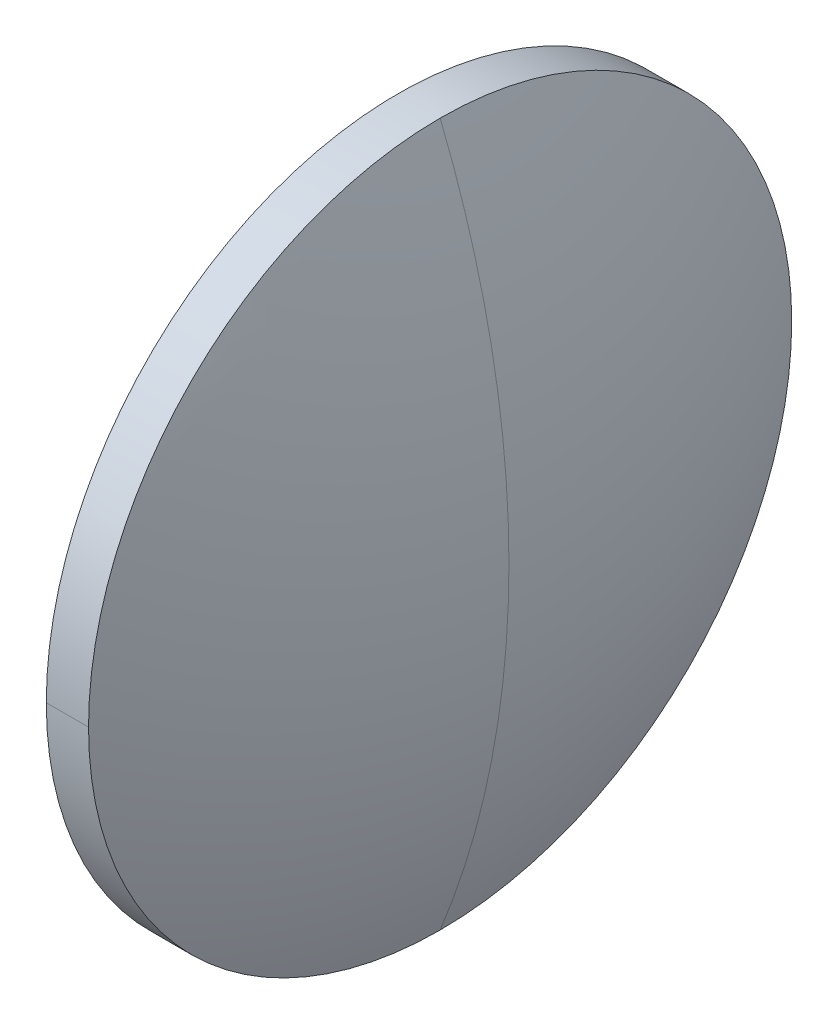
ISO-10303-21;
HEADER;
FILE_DESCRIPTION(('STEP AP214'),'2;1');
FILE_NAME('part.step','',(''),(''),'','','');
FILE_SCHEMA(('AUTOMOTIVE_DESIGN { 1 0 10303 214 1 1 1 1 }'));
ENDSEC;
DATA;
#1=APPLICATION_CONTEXT('core data for automotive mechanical design processes');
#2=APPLICATION_PROTOCOL_DEFINITION('international standard','automotive_design',2000,#1);
#3=PRODUCT_CONTEXT('',#1,'mechanical');
#4=PRODUCT('Part','Part','',(#3));
#5=PRODUCT_RELATED_PRODUCT_CATEGORY('part','',(#4));
#6=PRODUCT_DEFINITION_FORMATION('','',#4);
#7=PRODUCT_DEFINITION_CONTEXT('part definition',#1,'design');
#8=PRODUCT_DEFINITION('design','',#6,#7);
#9=PRODUCT_DEFINITION_SHAPE('','',#8);
#10=(LENGTH_UNIT() NAMED_UNIT(*) SI_UNIT(.MILLI.,.METRE.));
#11=(NAMED_UNIT(*) PLANE_ANGLE_UNIT() SI_UNIT($,.RADIAN.));
#12=(NAMED_UNIT(*) SI_UNIT($,.STERADIAN.) SOLID_ANGLE_UNIT());
#13=UNCERTAINTY_MEASURE_WITH_UNIT(LENGTH_MEASURE(1.E-05),#10,'distance_accuracy_value','');
#14=(GEOMETRIC_REPRESENTATION_CONTEXT(3) GLOBAL_UNCERTAINTY_ASSIGNED_CONTEXT((#13)) GLOBAL_UNIT_ASSIGNED_CONTEXT((#10,
#11,#12)) REPRESENTATION_CONTEXT('',''));
#15=CARTESIAN_POINT('',(0.,0.,0.));
#16=DIRECTION('',(0.,0.,1.));
#17=DIRECTION('',(1.,0.,0.));
#18=AXIS2_PLACEMENT_3D('',#15,#16,#17);
#19=CARTESIAN_POINT('',(2681.91820745224,-224.917697129705,0.));
#20=DIRECTION('',(-1.,0.,0.));
#21=DIRECTION('',(0.,0.,1.));
#22=AXIS2_PLACEMENT_3D('',#19,#20,#21);
#23=CYLINDRICAL_SURFACE('',#22,18.9952435828434);
#24=DIRECTION('',(-1.,0.,0.));
#25=VECTOR('',#24,1.);
#26=CARTESIAN_POINT('',(2681.91820745224,-224.917697129705,-18.9952435828434));
#27=LINE('',#26,#25);
#28=CARTESIAN_POINT('',(2690.96789109236,-224.917697129705,-18.9952435828434));
#29=VERTEX_POINT('',#28);
#30=CARTESIAN_POINT('',(2688.68565404854,-224.917697129705,-18.9952435828434));
#31=VERTEX_POINT('',#30);
#32=EDGE_CURVE('E19',#29,#31,#27,.T.);
#33=ORIENTED_EDGE('',*,*,#32,.F.);
#34=CARTESIAN_POINT('',(2690.96789109236,-224.917697129705,0.));
#35=DIRECTION('',(-1.,0.,0.));
#36=DIRECTION('',(0.,0.,1.));
#37=AXIS2_PLACEMENT_3D('',#34,#35,#36);
#38=CIRCLE('',#37,18.9952435828434);
#39=CARTESIAN_POINT('',(2690.96789109236,-243.912940712548,0.));
#40=VERTEX_POINT('',#39);
#41=EDGE_CURVE('E62',#29,#40,#38,.T.);
#42=ORIENTED_EDGE('',*,*,#41,.T.);
#43=CARTESIAN_POINT('',(2690.96789109236,-224.917697129705,0.));
#44=DIRECTION('',(-1.,0.,0.));
#45=DIRECTION('',(0.,0.,1.));
#46=AXIS2_PLACEMENT_3D('',#43,#44,#45);
#47=CIRCLE('',#46,18.9952435828434);
#48=CARTESIAN_POINT('',(2690.96789109236,-224.917697129705,18.9952435828434));
#49=VERTEX_POINT('',#48);
#50=EDGE_CURVE('E9',#40,#49,#47,.T.);
#51=ORIENTED_EDGE('',*,*,#50,.T.);
#52=DIRECTION('',(-1.,0.,0.));
#53=VECTOR('',#52,1.);
#54=CARTESIAN_POINT('',(2681.91820745224,-224.917697129705,18.9952435828434));
#55=LINE('',#54,#53);
#56=CARTESIAN_POINT('',(2688.68565404854,-224.917697129705,18.9952435828434));
#57=VERTEX_POINT('',#56);
#58=EDGE_CURVE('E87',#49,#57,#55,.T.);
#59=ORIENTED_EDGE('',*,*,#58,.T.);
#60=CARTESIAN_POINT('',(2688.68565404854,-224.917697129705,0.));
#61=DIRECTION('',(-1.,0.,0.));
#62=DIRECTION('',(0.,0.,1.));
#63=AXIS2_PLACEMENT_3D('',#60,#61,#62);
#64=CIRCLE('',#63,18.9952435828434);
#65=EDGE_CURVE('E25',#31,#57,#64,.T.);
#66=ORIENTED_EDGE('',*,*,#65,.F.);
#67=EDGE_LOOP('',(#33,#42,#51,#59,#66));
#68=FACE_BOUND('',#67,.T.);
#69=ADVANCED_FACE('F15',(#68),#23,.T.);
#70=CARTESIAN_POINT('',(2644.30037604853,-224.917697129705,0.));
#71=DIRECTION('',(0.,0.,-1.));
#72=DIRECTION('',(0.,1.,0.));
#73=AXIS2_PLACEMENT_3D('',#70,#71,#72);
#74=SPHERICAL_SURFACE('',#73,50.385278);
#75=CARTESIAN_POINT('',(2644.30037604853,-224.917697129705,0.));
#76=DIRECTION('',(0.,0.,-1.));
#77=DIRECTION('',(0.,1.,0.));
#78=AXIS2_PLACEMENT_3D('',#75,#76,#77);
#79=CIRCLE('',#78,50.3852779999999);
#80=CARTESIAN_POINT('',(2694.68565404853,-224.917697129705,0.));
#81=VERTEX_POINT('',#80);
#82=EDGE_CURVE('E48',#81,#40,#79,.T.);
#83=ORIENTED_EDGE('',*,*,#82,.F.);
#84=CARTESIAN_POINT('',(2644.30037604853,-224.917697129705,0.));
#85=DIRECTION('',(0.,0.,1.));
#86=DIRECTION('',(1.,0.,0.));
#87=AXIS2_PLACEMENT_3D('',#84,#85,#86);
#88=CIRCLE('',#87,50.3852779999998);
#89=CARTESIAN_POINT('',(2690.96789109236,-205.922453546861,0.));
#90=VERTEX_POINT('',#89);
#91=EDGE_CURVE('E71',#81,#90,#88,.T.);
#92=ORIENTED_EDGE('',*,*,#91,.T.);
#93=CARTESIAN_POINT('',(2690.96789109236,-224.917697129705,0.));
#94=DIRECTION('',(-1.,0.,0.));
#95=DIRECTION('',(0.,0.,1.));
#96=AXIS2_PLACEMENT_3D('',#93,#94,#95);
#97=CIRCLE('',#96,18.9952435828434);
#98=EDGE_CURVE('E90',#49,#90,#97,.T.);
#99=ORIENTED_EDGE('',*,*,#98,.F.);
#100=ORIENTED_EDGE('',*,*,#50,.F.);
#101=EDGE_LOOP('',(#83,#92,#99,#100));
#102=FACE_BOUND('',#101,.T.);
#103=ADVANCED_FACE('F17',(#102),#74,.T.);
#104=CARTESIAN_POINT('',(2688.68565404854,0.,0.));
#105=DIRECTION('',(-1.,0.,0.));
#106=DIRECTION('',(0.,0.,1.));
#107=AXIS2_PLACEMENT_3D('',#104,#105,#106);
#108=PLANE('',#107);
#109=CARTESIAN_POINT('',(2688.68565404854,-224.917697129705,0.));
#110=DIRECTION('',(-1.,0.,0.));
#111=DIRECTION('',(0.,0.,1.));
#112=AXIS2_PLACEMENT_3D('',#109,#110,#111);
#113=CIRCLE('',#112,18.9952435828434);
#114=EDGE_CURVE('E81',#57,#31,#113,.T.);
#115=ORIENTED_EDGE('',*,*,#114,.T.);
#116=ORIENTED_EDGE('',*,*,#65,.T.);
#117=EDGE_LOOP('',(#115,#116));
#118=FACE_BOUND('',#117,.T.);
#119=ADVANCED_FACE('F79',(#118),#108,.T.);
#120=CARTESIAN_POINT('',(2644.30037604853,-224.917697129705,0.));
#121=DIRECTION('',(0.,0.,-1.));
#122=DIRECTION('',(0.,1.,0.));
#123=AXIS2_PLACEMENT_3D('',#120,#121,#122);
#124=SPHERICAL_SURFACE('',#123,50.385278);
#125=ORIENTED_EDGE('',*,*,#91,.F.);
#126=ORIENTED_EDGE('',*,*,#82,.T.);
#127=ORIENTED_EDGE('',*,*,#41,.F.);
#128=CARTESIAN_POINT('',(2690.96789109236,-224.917697129705,0.));
#129=DIRECTION('',(-1.,0.,0.));
#130=DIRECTION('',(0.,0.,1.));
#131=AXIS2_PLACEMENT_3D('',#128,#129,#130);
#132=CIRCLE('',#131,18.9952435828434);
#133=EDGE_CURVE('E100',#90,#29,#132,.T.);
#134=ORIENTED_EDGE('',*,*,#133,.F.);
#135=EDGE_LOOP('',(#125,#126,#127,#134));
#136=FACE_BOUND('',#135,.T.);
#137=ADVANCED_FACE('F112',(#136),#124,.T.);
#138=CARTESIAN_POINT('',(2681.91820745224,-224.917697129705,0.));
#139=DIRECTION('',(-1.,0.,0.));
#140=DIRECTION('',(0.,0.,1.));
#141=AXIS2_PLACEMENT_3D('',#138,#139,#140);
#142=CYLINDRICAL_SURFACE('',#141,18.9952435828434);
#143=ORIENTED_EDGE('',*,*,#133,.T.);
#144=ORIENTED_EDGE('',*,*,#32,.T.);
#145=ORIENTED_EDGE('',*,*,#114,.F.);
#146=ORIENTED_EDGE('',*,*,#58,.F.);
#147=ORIENTED_EDGE('',*,*,#98,.T.);
#148=EDGE_LOOP('',(#143,#144,#145,#146,#147));
#149=FACE_BOUND('',#148,.T.);
#150=ADVANCED_FACE('F93',(#149),#142,.T.);
#151=CLOSED_SHELL('',(#69,#103,#119,#137,#150));
#152=MANIFOLD_SOLID_BREP('B1',#151);
#153=ADVANCED_BREP_SHAPE_REPRESENTATION('',(#18,#152),#14);
#154=SHAPE_DEFINITION_REPRESENTATION(#9,#153);
ENDSEC;
END-ISO-10303-21;
